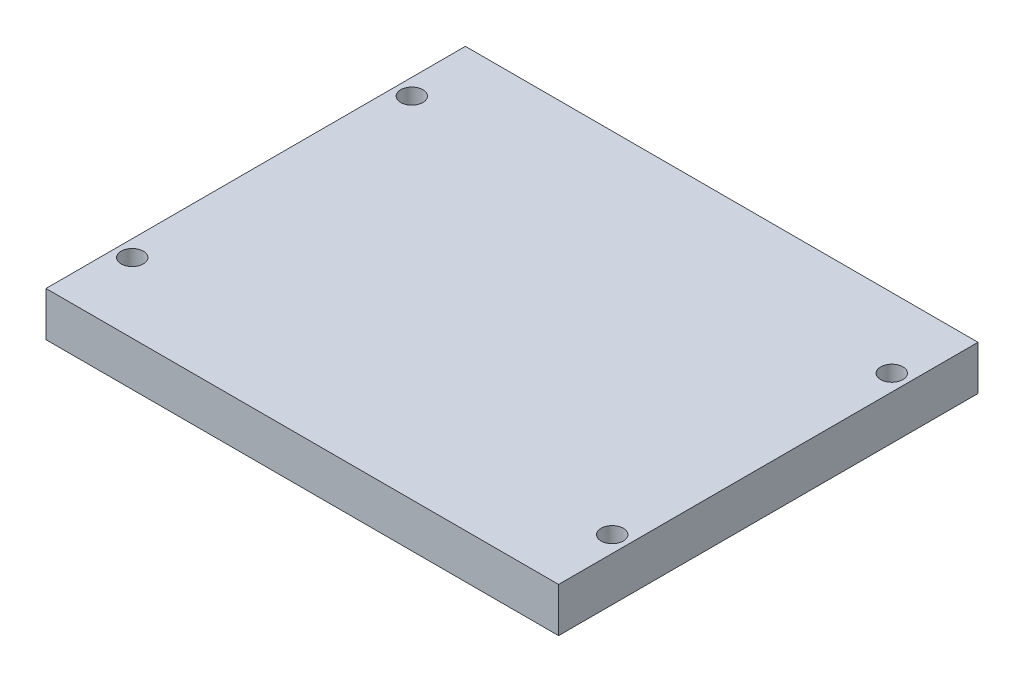
ISO-10303-21;
HEADER;
FILE_DESCRIPTION(('STEP AP214'),'2;1');
FILE_NAME('part.step','',(''),(''),'','','');
FILE_SCHEMA(('AUTOMOTIVE_DESIGN { 1 0 10303 214 1 1 1 1 }'));
ENDSEC;
DATA;
#1=APPLICATION_CONTEXT('core data for automotive mechanical design processes');
#2=APPLICATION_PROTOCOL_DEFINITION('international standard','automotive_design',2000,#1);
#3=PRODUCT_CONTEXT('',#1,'mechanical');
#4=PRODUCT('Part','Part','',(#3));
#5=PRODUCT_RELATED_PRODUCT_CATEGORY('part','',(#4));
#6=PRODUCT_DEFINITION_FORMATION('','',#4);
#7=PRODUCT_DEFINITION_CONTEXT('part definition',#1,'design');
#8=PRODUCT_DEFINITION('design','',#6,#7);
#9=PRODUCT_DEFINITION_SHAPE('','',#8);
#10=(LENGTH_UNIT() NAMED_UNIT(*) SI_UNIT(.MILLI.,.METRE.));
#11=(NAMED_UNIT(*) PLANE_ANGLE_UNIT() SI_UNIT($,.RADIAN.));
#12=(NAMED_UNIT(*) SI_UNIT($,.STERADIAN.) SOLID_ANGLE_UNIT());
#13=UNCERTAINTY_MEASURE_WITH_UNIT(LENGTH_MEASURE(1.E-05),#10,'distance_accuracy_value','');
#14=(GEOMETRIC_REPRESENTATION_CONTEXT(3) GLOBAL_UNCERTAINTY_ASSIGNED_CONTEXT((#13)) GLOBAL_UNIT_ASSIGNED_CONTEXT((#10,
#11,#12)) REPRESENTATION_CONTEXT('',''));
#15=CARTESIAN_POINT('',(0.,0.,0.));
#16=DIRECTION('',(0.,0.,1.));
#17=DIRECTION('',(1.,0.,0.));
#18=AXIS2_PLACEMENT_3D('',#15,#16,#17);
#19=CARTESIAN_POINT('',(0.,9.525,0.));
#20=DIRECTION('',(1.,0.,0.));
#21=DIRECTION('',(0.,0.,-1.));
#22=AXIS2_PLACEMENT_3D('',#19,#20,#21);
#23=PLANE('',#22);
#24=DIRECTION('',(0.,0.,1.));
#25=VECTOR('',#24,1.);
#26=CARTESIAN_POINT('',(0.,0.,0.));
#27=LINE('',#26,#25);
#28=CARTESIAN_POINT('',(0.,0.,-90.));
#29=VERTEX_POINT('',#28);
#30=CARTESIAN_POINT('',(0.,0.,0.));
#31=VERTEX_POINT('',#30);
#32=EDGE_CURVE('E96',#29,#31,#27,.T.);
#33=ORIENTED_EDGE('',*,*,#32,.T.);
#34=DIRECTION('',(0.,-1.,0.));
#35=VECTOR('',#34,1.);
#36=CARTESIAN_POINT('',(0.,9.525,0.));
#37=LINE('',#36,#35);
#38=CARTESIAN_POINT('',(0.,9.525,0.));
#39=VERTEX_POINT('',#38);
#40=EDGE_CURVE('E11',#39,#31,#37,.T.);
#41=ORIENTED_EDGE('',*,*,#40,.F.);
#42=DIRECTION('',(0.,0.,1.));
#43=VECTOR('',#42,1.);
#44=CARTESIAN_POINT('',(0.,9.525,0.));
#45=LINE('',#44,#43);
#46=CARTESIAN_POINT('',(0.,9.525,-90.));
#47=VERTEX_POINT('',#46);
#48=EDGE_CURVE('E84',#47,#39,#45,.T.);
#49=ORIENTED_EDGE('',*,*,#48,.F.);
#50=DIRECTION('',(0.,-1.,0.));
#51=VECTOR('',#50,1.);
#52=CARTESIAN_POINT('',(0.,9.525,-90.));
#53=LINE('',#52,#51);
#54=EDGE_CURVE('E92',#47,#29,#53,.T.);
#55=ORIENTED_EDGE('',*,*,#54,.T.);
#56=EDGE_LOOP('',(#33,#41,#49,#55));
#57=FACE_BOUND('',#56,.T.);
#58=ADVANCED_FACE('F33',(#57),#23,.F.);
#59=CARTESIAN_POINT('',(0.,9.525,0.));
#60=DIRECTION('',(0.,0.,-1.));
#61=DIRECTION('',(-1.,0.,0.));
#62=AXIS2_PLACEMENT_3D('',#59,#60,#61);
#63=PLANE('',#62);
#64=DIRECTION('',(1.,0.,0.));
#65=VECTOR('',#64,1.);
#66=CARTESIAN_POINT('',(0.,0.,0.));
#67=LINE('',#66,#65);
#68=CARTESIAN_POINT('',(110.,0.,0.));
#69=VERTEX_POINT('',#68);
#70=EDGE_CURVE('E88',#31,#69,#67,.T.);
#71=ORIENTED_EDGE('',*,*,#70,.T.);
#72=DIRECTION('',(0.,-1.,0.));
#73=VECTOR('',#72,1.);
#74=CARTESIAN_POINT('',(110.,9.525,0.));
#75=LINE('',#74,#73);
#76=CARTESIAN_POINT('',(110.,9.525,0.));
#77=VERTEX_POINT('',#76);
#78=EDGE_CURVE('E41',#77,#69,#75,.T.);
#79=ORIENTED_EDGE('',*,*,#78,.F.);
#80=DIRECTION('',(1.,0.,0.));
#81=VECTOR('',#80,1.);
#82=CARTESIAN_POINT('',(0.,9.525,0.));
#83=LINE('',#82,#81);
#84=EDGE_CURVE('E79',#39,#77,#83,.T.);
#85=ORIENTED_EDGE('',*,*,#84,.F.);
#86=ORIENTED_EDGE('',*,*,#40,.T.);
#87=EDGE_LOOP('',(#71,#79,#85,#86));
#88=FACE_BOUND('',#87,.T.);
#89=ADVANCED_FACE('F87',(#88),#63,.F.);
#90=CARTESIAN_POINT('',(110.,9.525,0.));
#91=DIRECTION('',(-1.,0.,0.));
#92=DIRECTION('',(0.,0.,1.));
#93=AXIS2_PLACEMENT_3D('',#90,#91,#92);
#94=PLANE('',#93);
#95=DIRECTION('',(0.,0.,-1.));
#96=VECTOR('',#95,1.);
#97=CARTESIAN_POINT('',(110.,0.,0.));
#98=LINE('',#97,#96);
#99=CARTESIAN_POINT('',(110.,0.,-90.));
#100=VERTEX_POINT('',#99);
#101=EDGE_CURVE('E66',#69,#100,#98,.T.);
#102=ORIENTED_EDGE('',*,*,#101,.T.);
#103=DIRECTION('',(0.,-1.,0.));
#104=VECTOR('',#103,1.);
#105=CARTESIAN_POINT('',(110.,9.525,-90.));
#106=LINE('',#105,#104);
#107=CARTESIAN_POINT('',(110.,9.525,-90.));
#108=VERTEX_POINT('',#107);
#109=EDGE_CURVE('E89',#108,#100,#106,.T.);
#110=ORIENTED_EDGE('',*,*,#109,.F.);
#111=DIRECTION('',(0.,0.,-1.));
#112=VECTOR('',#111,1.);
#113=CARTESIAN_POINT('',(110.,9.525,0.));
#114=LINE('',#113,#112);
#115=EDGE_CURVE('E82',#77,#108,#114,.T.);
#116=ORIENTED_EDGE('',*,*,#115,.F.);
#117=ORIENTED_EDGE('',*,*,#78,.T.);
#118=EDGE_LOOP('',(#102,#110,#116,#117));
#119=FACE_BOUND('',#118,.T.);
#120=ADVANCED_FACE('F90',(#119),#94,.F.);
#121=CARTESIAN_POINT('',(0.,9.525,-90.));
#122=DIRECTION('',(0.,0.,1.));
#123=DIRECTION('',(1.,0.,0.));
#124=AXIS2_PLACEMENT_3D('',#121,#122,#123);
#125=PLANE('',#124);
#126=DIRECTION('',(-1.,0.,0.));
#127=VECTOR('',#126,1.);
#128=CARTESIAN_POINT('',(0.,0.,-90.));
#129=LINE('',#128,#127);
#130=EDGE_CURVE('E72',#100,#29,#129,.T.);
#131=ORIENTED_EDGE('',*,*,#130,.T.);
#132=ORIENTED_EDGE('',*,*,#54,.F.);
#133=DIRECTION('',(-1.,0.,0.));
#134=VECTOR('',#133,1.);
#135=CARTESIAN_POINT('',(0.,9.525,-90.));
#136=LINE('',#135,#134);
#137=EDGE_CURVE('E49',#108,#47,#136,.T.);
#138=ORIENTED_EDGE('',*,*,#137,.F.);
#139=ORIENTED_EDGE('',*,*,#109,.T.);
#140=EDGE_LOOP('',(#131,#132,#138,#139));
#141=FACE_BOUND('',#140,.T.);
#142=ADVANCED_FACE('F104',(#141),#125,.F.);
#143=CARTESIAN_POINT('',(0.,9.525,0.));
#144=DIRECTION('',(0.,-1.,0.));
#145=DIRECTION('',(0.,0.,-1.));
#146=AXIS2_PLACEMENT_3D('',#143,#144,#145);
#147=PLANE('',#146);
#148=CARTESIAN_POINT('',(3.5,9.525,-15.));
#149=DIRECTION('',(0.,1.,0.));
#150=DIRECTION('',(0.,0.,1.));
#151=AXIS2_PLACEMENT_3D('',#148,#149,#150);
#152=CIRCLE('',#151,2.38125);
#153=CARTESIAN_POINT('',(3.5,9.525,-12.61875));
#154=VERTEX_POINT('',#153);
#155=EDGE_CURVE('E128',#154,#154,#152,.T.);
#156=ORIENTED_EDGE('',*,*,#155,.F.);
#157=EDGE_LOOP('',(#156));
#158=FACE_BOUND('',#157,.T.);
#159=CARTESIAN_POINT('',(3.49999999999999,9.525,-75.));
#160=DIRECTION('',(0.,1.,0.));
#161=DIRECTION('',(0.,0.,1.));
#162=AXIS2_PLACEMENT_3D('',#159,#160,#161);
#163=CIRCLE('',#162,2.38125);
#164=CARTESIAN_POINT('',(3.49999999999999,9.525,-72.61875));
#165=VERTEX_POINT('',#164);
#166=EDGE_CURVE('E122',#165,#165,#163,.T.);
#167=ORIENTED_EDGE('',*,*,#166,.F.);
#168=EDGE_LOOP('',(#167));
#169=FACE_BOUND('',#168,.T.);
#170=CARTESIAN_POINT('',(106.5,9.525,-75.));
#171=DIRECTION('',(0.,1.,0.));
#172=DIRECTION('',(0.,0.,1.));
#173=AXIS2_PLACEMENT_3D('',#170,#171,#172);
#174=CIRCLE('',#173,2.38125);
#175=CARTESIAN_POINT('',(106.5,9.525,-72.61875));
#176=VERTEX_POINT('',#175);
#177=EDGE_CURVE('E116',#176,#176,#174,.T.);
#178=ORIENTED_EDGE('',*,*,#177,.F.);
#179=EDGE_LOOP('',(#178));
#180=FACE_BOUND('',#179,.T.);
#181=CARTESIAN_POINT('',(106.5,9.525,-15.));
#182=DIRECTION('',(0.,1.,0.));
#183=DIRECTION('',(0.,0.,1.));
#184=AXIS2_PLACEMENT_3D('',#181,#182,#183);
#185=CIRCLE('',#184,2.38125000000001);
#186=CARTESIAN_POINT('',(106.5,9.525,-12.61875));
#187=VERTEX_POINT('',#186);
#188=EDGE_CURVE('E110',#187,#187,#185,.T.);
#189=ORIENTED_EDGE('',*,*,#188,.F.);
#190=EDGE_LOOP('',(#189));
#191=FACE_BOUND('',#190,.T.);
#192=ORIENTED_EDGE('',*,*,#48,.T.);
#193=ORIENTED_EDGE('',*,*,#84,.T.);
#194=ORIENTED_EDGE('',*,*,#115,.T.);
#195=ORIENTED_EDGE('',*,*,#137,.T.);
#196=EDGE_LOOP('',(#192,#193,#194,#195));
#197=FACE_BOUND('',#196,.T.);
#198=ADVANCED_FACE('F80',(#158,#169,#180,#191,#197),#147,.F.);
#199=CARTESIAN_POINT('',(0.,0.,0.));
#200=DIRECTION('',(0.,-1.,0.));
#201=DIRECTION('',(0.,0.,-1.));
#202=AXIS2_PLACEMENT_3D('',#199,#200,#201);
#203=PLANE('',#202);
#204=CARTESIAN_POINT('',(3.5,0.,-15.));
#205=DIRECTION('',(0.,1.,0.));
#206=DIRECTION('',(0.,0.,1.));
#207=AXIS2_PLACEMENT_3D('',#204,#205,#206);
#208=CIRCLE('',#207,2.38125);
#209=CARTESIAN_POINT('',(3.5,0.,-12.61875));
#210=VERTEX_POINT('',#209);
#211=EDGE_CURVE('E125',#210,#210,#208,.T.);
#212=ORIENTED_EDGE('',*,*,#211,.T.);
#213=EDGE_LOOP('',(#212));
#214=FACE_BOUND('',#213,.T.);
#215=CARTESIAN_POINT('',(3.49999999999999,0.,-75.));
#216=DIRECTION('',(0.,1.,0.));
#217=DIRECTION('',(0.,0.,1.));
#218=AXIS2_PLACEMENT_3D('',#215,#216,#217);
#219=CIRCLE('',#218,2.38125);
#220=CARTESIAN_POINT('',(3.49999999999999,0.,-72.61875));
#221=VERTEX_POINT('',#220);
#222=EDGE_CURVE('E119',#221,#221,#219,.T.);
#223=ORIENTED_EDGE('',*,*,#222,.T.);
#224=EDGE_LOOP('',(#223));
#225=FACE_BOUND('',#224,.T.);
#226=CARTESIAN_POINT('',(106.5,0.,-75.));
#227=DIRECTION('',(0.,1.,0.));
#228=DIRECTION('',(0.,0.,1.));
#229=AXIS2_PLACEMENT_3D('',#226,#227,#228);
#230=CIRCLE('',#229,2.38125);
#231=CARTESIAN_POINT('',(106.5,0.,-72.61875));
#232=VERTEX_POINT('',#231);
#233=EDGE_CURVE('E113',#232,#232,#230,.T.);
#234=ORIENTED_EDGE('',*,*,#233,.T.);
#235=EDGE_LOOP('',(#234));
#236=FACE_BOUND('',#235,.T.);
#237=CARTESIAN_POINT('',(106.5,0.,-15.));
#238=DIRECTION('',(0.,1.,0.));
#239=DIRECTION('',(0.,0.,1.));
#240=AXIS2_PLACEMENT_3D('',#237,#238,#239);
#241=CIRCLE('',#240,2.38125000000001);
#242=CARTESIAN_POINT('',(106.5,0.,-12.61875));
#243=VERTEX_POINT('',#242);
#244=EDGE_CURVE('E99',#243,#243,#241,.T.);
#245=ORIENTED_EDGE('',*,*,#244,.T.);
#246=EDGE_LOOP('',(#245));
#247=FACE_BOUND('',#246,.T.);
#248=ORIENTED_EDGE('',*,*,#32,.F.);
#249=ORIENTED_EDGE('',*,*,#130,.F.);
#250=ORIENTED_EDGE('',*,*,#101,.F.);
#251=ORIENTED_EDGE('',*,*,#70,.F.);
#252=EDGE_LOOP('',(#248,#249,#250,#251));
#253=FACE_BOUND('',#252,.T.);
#254=ADVANCED_FACE('F107',(#214,#225,#236,#247,#253),#203,.T.);
#255=CARTESIAN_POINT('',(106.5,0.,-15.));
#256=DIRECTION('',(0.,1.,0.));
#257=DIRECTION('',(0.,0.,1.));
#258=AXIS2_PLACEMENT_3D('',#255,#256,#257);
#259=CYLINDRICAL_SURFACE('',#258,2.38125000000001);
#260=ORIENTED_EDGE('',*,*,#244,.F.);
#261=EDGE_LOOP('',(#260));
#262=FACE_BOUND('',#261,.T.);
#263=ORIENTED_EDGE('',*,*,#188,.T.);
#264=EDGE_LOOP('',(#263));
#265=FACE_BOUND('',#264,.T.);
#266=ADVANCED_FACE('F152',(#262,#265),#259,.F.);
#267=CARTESIAN_POINT('',(106.5,0.,-75.));
#268=DIRECTION('',(0.,1.,0.));
#269=DIRECTION('',(0.,0.,1.));
#270=AXIS2_PLACEMENT_3D('',#267,#268,#269);
#271=CYLINDRICAL_SURFACE('',#270,2.38125);
#272=ORIENTED_EDGE('',*,*,#233,.F.);
#273=EDGE_LOOP('',(#272));
#274=FACE_BOUND('',#273,.T.);
#275=ORIENTED_EDGE('',*,*,#177,.T.);
#276=EDGE_LOOP('',(#275));
#277=FACE_BOUND('',#276,.T.);
#278=ADVANCED_FACE('F154',(#274,#277),#271,.F.);
#279=CARTESIAN_POINT('',(3.49999999999999,0.,-75.));
#280=DIRECTION('',(0.,1.,0.));
#281=DIRECTION('',(0.,0.,1.));
#282=AXIS2_PLACEMENT_3D('',#279,#280,#281);
#283=CYLINDRICAL_SURFACE('',#282,2.38125);
#284=ORIENTED_EDGE('',*,*,#222,.F.);
#285=EDGE_LOOP('',(#284));
#286=FACE_BOUND('',#285,.T.);
#287=ORIENTED_EDGE('',*,*,#166,.T.);
#288=EDGE_LOOP('',(#287));
#289=FACE_BOUND('',#288,.T.);
#290=ADVANCED_FACE('F139',(#286,#289),#283,.F.);
#291=CARTESIAN_POINT('',(3.5,0.,-15.));
#292=DIRECTION('',(0.,1.,0.));
#293=DIRECTION('',(0.,0.,1.));
#294=AXIS2_PLACEMENT_3D('',#291,#292,#293);
#295=CYLINDRICAL_SURFACE('',#294,2.38125);
#296=ORIENTED_EDGE('',*,*,#211,.F.);
#297=EDGE_LOOP('',(#296));
#298=FACE_BOUND('',#297,.T.);
#299=ORIENTED_EDGE('',*,*,#155,.T.);
#300=EDGE_LOOP('',(#299));
#301=FACE_BOUND('',#300,.T.);
#302=ADVANCED_FACE('F136',(#298,#301),#295,.F.);
#303=CLOSED_SHELL('',(#58,#89,#120,#142,#198,#254,#266,#278,#290,#302));
#304=MANIFOLD_SOLID_BREP('B2',#303);
#305=ADVANCED_BREP_SHAPE_REPRESENTATION('',(#18,#304),#14);
#306=SHAPE_DEFINITION_REPRESENTATION(#9,#305);
ENDSEC;
END-ISO-10303-21;
